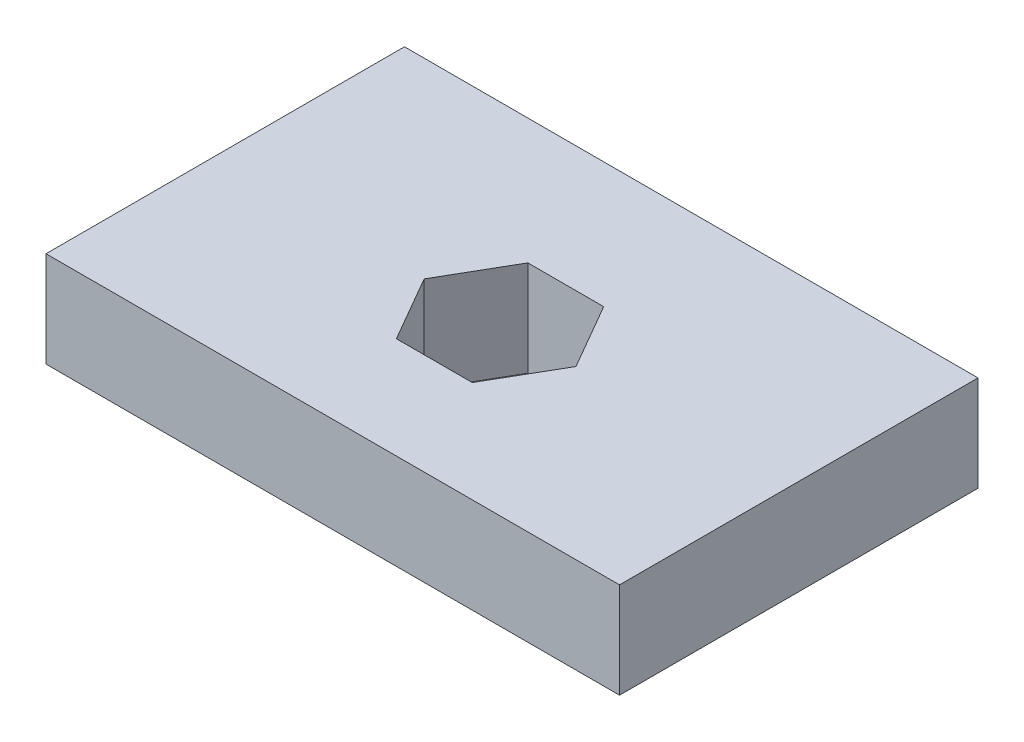
ISO-10303-21;
HEADER;
FILE_DESCRIPTION(('STEP AP214'),'2;1');
FILE_NAME('part.step','',(''),(''),'','','');
FILE_SCHEMA(('AUTOMOTIVE_DESIGN { 1 0 10303 214 1 1 1 1 }'));
ENDSEC;
DATA;
#1=APPLICATION_CONTEXT('core data for automotive mechanical design processes');
#2=APPLICATION_PROTOCOL_DEFINITION('international standard','automotive_design',2000,#1);
#3=PRODUCT_CONTEXT('',#1,'mechanical');
#4=PRODUCT('Part','Part','',(#3));
#5=PRODUCT_RELATED_PRODUCT_CATEGORY('part','',(#4));
#6=PRODUCT_DEFINITION_FORMATION('','',#4);
#7=PRODUCT_DEFINITION_CONTEXT('part definition',#1,'design');
#8=PRODUCT_DEFINITION('design','',#6,#7);
#9=PRODUCT_DEFINITION_SHAPE('','',#8);
#10=(LENGTH_UNIT() NAMED_UNIT(*) SI_UNIT(.MILLI.,.METRE.));
#11=(NAMED_UNIT(*) PLANE_ANGLE_UNIT() SI_UNIT($,.RADIAN.));
#12=(NAMED_UNIT(*) SI_UNIT($,.STERADIAN.) SOLID_ANGLE_UNIT());
#13=UNCERTAINTY_MEASURE_WITH_UNIT(LENGTH_MEASURE(1.E-05),#10,'distance_accuracy_value','');
#14=(GEOMETRIC_REPRESENTATION_CONTEXT(3) GLOBAL_UNCERTAINTY_ASSIGNED_CONTEXT((#13)) GLOBAL_UNIT_ASSIGNED_CONTEXT((#10,
#11,#12)) REPRESENTATION_CONTEXT('',''));
#15=CARTESIAN_POINT('',(0.,0.,0.));
#16=DIRECTION('',(0.,0.,1.));
#17=DIRECTION('',(1.,0.,0.));
#18=AXIS2_PLACEMENT_3D('',#15,#16,#17);
#19=CARTESIAN_POINT('',(-38.1,12.7,-25.4));
#20=DIRECTION('',(0.,-1.,0.));
#21=DIRECTION('',(0.,0.,-1.));
#22=AXIS2_PLACEMENT_3D('',#19,#20,#21);
#23=PLANE('',#22);
#24=DIRECTION('',(0.,0.,1.));
#25=VECTOR('',#24,1.);
#26=CARTESIAN_POINT('',(-38.1,12.7,22.225));
#27=LINE('',#26,#25);
#28=CARTESIAN_POINT('',(-38.1,12.7,-25.4));
#29=VERTEX_POINT('',#28);
#30=CARTESIAN_POINT('',(-38.1,12.7,22.225));
#31=VERTEX_POINT('',#30);
#32=EDGE_CURVE('E161',#29,#31,#27,.T.);
#33=ORIENTED_EDGE('',*,*,#32,.T.);
#34=DIRECTION('',(1.,0.,0.));
#35=VECTOR('',#34,1.);
#36=CARTESIAN_POINT('',(38.1,12.7,22.225));
#37=LINE('',#36,#35);
#38=CARTESIAN_POINT('',(38.1,12.7,22.225));
#39=VERTEX_POINT('',#38);
#40=EDGE_CURVE('E164',#31,#39,#37,.T.);
#41=ORIENTED_EDGE('',*,*,#40,.T.);
#42=DIRECTION('',(0.,0.,-1.));
#43=VECTOR('',#42,1.);
#44=CARTESIAN_POINT('',(38.1,12.7,-25.4));
#45=LINE('',#44,#43);
#46=CARTESIAN_POINT('',(38.1,12.7,-25.4));
#47=VERTEX_POINT('',#46);
#48=EDGE_CURVE('E167',#39,#47,#45,.T.);
#49=ORIENTED_EDGE('',*,*,#48,.T.);
#50=DIRECTION('',(-1.,0.,0.));
#51=VECTOR('',#50,1.);
#52=CARTESIAN_POINT('',(-38.1,12.7,-25.4));
#53=LINE('',#52,#51);
#54=EDGE_CURVE('E169',#47,#29,#53,.T.);
#55=ORIENTED_EDGE('',*,*,#54,.T.);
#56=EDGE_LOOP('',(#33,#41,#49,#55));
#57=FACE_BOUND('',#56,.T.);
#58=DIRECTION('',(0.5,0.,-0.866025403784439));
#59=VECTOR('',#58,1.);
#60=CARTESIAN_POINT('',(5.04098953786192,12.7,8.73125));
#61=LINE('',#60,#59);
#62=CARTESIAN_POINT('',(5.04098953786192,12.7,8.73125));
#63=VERTEX_POINT('',#62);
#64=CARTESIAN_POINT('',(10.0819790757238,12.7,0.));
#65=VERTEX_POINT('',#64);
#66=EDGE_CURVE('E108',#63,#65,#61,.T.);
#67=ORIENTED_EDGE('',*,*,#66,.F.);
#68=DIRECTION('',(1.,0.,0.));
#69=VECTOR('',#68,1.);
#70=CARTESIAN_POINT('',(-5.04098953786192,12.7,8.73125));
#71=LINE('',#70,#69);
#72=CARTESIAN_POINT('',(-5.04098953786192,12.7,8.73125));
#73=VERTEX_POINT('',#72);
#74=EDGE_CURVE('E138',#73,#63,#71,.T.);
#75=ORIENTED_EDGE('',*,*,#74,.F.);
#76=DIRECTION('',(0.5,0.,0.866025403784439));
#77=VECTOR('',#76,1.);
#78=CARTESIAN_POINT('',(-10.0819790757238,12.7,0.));
#79=LINE('',#78,#77);
#80=CARTESIAN_POINT('',(-10.0819790757238,12.7,0.));
#81=VERTEX_POINT('',#80);
#82=EDGE_CURVE('E136',#81,#73,#79,.T.);
#83=ORIENTED_EDGE('',*,*,#82,.F.);
#84=DIRECTION('',(-0.5,0.,0.866025403784439));
#85=VECTOR('',#84,1.);
#86=CARTESIAN_POINT('',(-5.04098953786192,12.7,-8.73125));
#87=LINE('',#86,#85);
#88=CARTESIAN_POINT('',(-5.04098953786192,12.7,-8.73125));
#89=VERTEX_POINT('',#88);
#90=EDGE_CURVE('E131',#89,#81,#87,.T.);
#91=ORIENTED_EDGE('',*,*,#90,.F.);
#92=DIRECTION('',(-1.,0.,0.));
#93=VECTOR('',#92,1.);
#94=CARTESIAN_POINT('',(5.04098953786192,12.7,-8.73125));
#95=LINE('',#94,#93);
#96=CARTESIAN_POINT('',(5.04098953786192,12.7,-8.73125));
#97=VERTEX_POINT('',#96);
#98=EDGE_CURVE('E129',#97,#89,#95,.T.);
#99=ORIENTED_EDGE('',*,*,#98,.F.);
#100=DIRECTION('',(-0.5,0.,-0.866025403784439));
#101=VECTOR('',#100,1.);
#102=CARTESIAN_POINT('',(10.0819790757238,12.7,0.));
#103=LINE('',#102,#101);
#104=EDGE_CURVE('E116',#65,#97,#103,.T.);
#105=ORIENTED_EDGE('',*,*,#104,.F.);
#106=EDGE_LOOP('',(#67,#75,#83,#91,#99,#105));
#107=FACE_BOUND('',#106,.T.);
#108=ADVANCED_FACE('F31',(#57,#107),#23,.F.);
#109=CARTESIAN_POINT('',(-38.1,0.,-25.4));
#110=DIRECTION('',(0.,-1.,0.));
#111=DIRECTION('',(0.,0.,-1.));
#112=AXIS2_PLACEMENT_3D('',#109,#110,#111);
#113=PLANE('',#112);
#114=DIRECTION('',(0.,0.,1.));
#115=VECTOR('',#114,1.);
#116=CARTESIAN_POINT('',(-38.1,0.,22.225));
#117=LINE('',#116,#115);
#118=CARTESIAN_POINT('',(-38.1,0.,-25.4));
#119=VERTEX_POINT('',#118);
#120=CARTESIAN_POINT('',(-38.1,0.,22.225));
#121=VERTEX_POINT('',#120);
#122=EDGE_CURVE('E124',#119,#121,#117,.T.);
#123=ORIENTED_EDGE('',*,*,#122,.F.);
#124=DIRECTION('',(-1.,0.,0.));
#125=VECTOR('',#124,1.);
#126=CARTESIAN_POINT('',(-38.1,0.,-25.4));
#127=LINE('',#126,#125);
#128=CARTESIAN_POINT('',(38.1,0.,-25.4));
#129=VERTEX_POINT('',#128);
#130=EDGE_CURVE('E165',#129,#119,#127,.T.);
#131=ORIENTED_EDGE('',*,*,#130,.F.);
#132=DIRECTION('',(0.,0.,-1.));
#133=VECTOR('',#132,1.);
#134=CARTESIAN_POINT('',(38.1,0.,-25.4));
#135=LINE('',#134,#133);
#136=CARTESIAN_POINT('',(38.1,0.,22.225));
#137=VERTEX_POINT('',#136);
#138=EDGE_CURVE('E176',#137,#129,#135,.T.);
#139=ORIENTED_EDGE('',*,*,#138,.F.);
#140=DIRECTION('',(1.,0.,0.));
#141=VECTOR('',#140,1.);
#142=CARTESIAN_POINT('',(38.1,0.,22.225));
#143=LINE('',#142,#141);
#144=EDGE_CURVE('E174',#121,#137,#143,.T.);
#145=ORIENTED_EDGE('',*,*,#144,.F.);
#146=EDGE_LOOP('',(#123,#131,#139,#145));
#147=FACE_BOUND('',#146,.T.);
#148=DIRECTION('',(1.,0.,0.));
#149=VECTOR('',#148,1.);
#150=CARTESIAN_POINT('',(-5.04098953786192,0.,8.73125));
#151=LINE('',#150,#149);
#152=CARTESIAN_POINT('',(-5.04098953786192,0.,8.73125));
#153=VERTEX_POINT('',#152);
#154=CARTESIAN_POINT('',(5.04098953786192,0.,8.73125));
#155=VERTEX_POINT('',#154);
#156=EDGE_CURVE('E117',#153,#155,#151,.T.);
#157=ORIENTED_EDGE('',*,*,#156,.T.);
#158=DIRECTION('',(0.5,0.,-0.866025403784439));
#159=VECTOR('',#158,1.);
#160=CARTESIAN_POINT('',(5.04098953786192,0.,8.73125));
#161=LINE('',#160,#159);
#162=CARTESIAN_POINT('',(10.0819790757238,0.,0.));
#163=VERTEX_POINT('',#162);
#164=EDGE_CURVE('E54',#155,#163,#161,.T.);
#165=ORIENTED_EDGE('',*,*,#164,.T.);
#166=DIRECTION('',(-0.5,0.,-0.866025403784439));
#167=VECTOR('',#166,1.);
#168=CARTESIAN_POINT('',(10.0819790757238,0.,0.));
#169=LINE('',#168,#167);
#170=CARTESIAN_POINT('',(5.04098953786192,0.,-8.73125));
#171=VERTEX_POINT('',#170);
#172=EDGE_CURVE('E123',#163,#171,#169,.T.);
#173=ORIENTED_EDGE('',*,*,#172,.T.);
#174=DIRECTION('',(-1.,0.,0.));
#175=VECTOR('',#174,1.);
#176=CARTESIAN_POINT('',(5.04098953786192,0.,-8.73125));
#177=LINE('',#176,#175);
#178=CARTESIAN_POINT('',(-5.04098953786192,0.,-8.73125));
#179=VERTEX_POINT('',#178);
#180=EDGE_CURVE('E143',#171,#179,#177,.T.);
#181=ORIENTED_EDGE('',*,*,#180,.T.);
#182=DIRECTION('',(-0.5,0.,0.866025403784439));
#183=VECTOR('',#182,1.);
#184=CARTESIAN_POINT('',(-5.04098953786192,0.,-8.73125));
#185=LINE('',#184,#183);
#186=CARTESIAN_POINT('',(-10.0819790757238,0.,0.));
#187=VERTEX_POINT('',#186);
#188=EDGE_CURVE('E146',#179,#187,#185,.T.);
#189=ORIENTED_EDGE('',*,*,#188,.T.);
#190=DIRECTION('',(0.5,0.,0.866025403784439));
#191=VECTOR('',#190,1.);
#192=CARTESIAN_POINT('',(-10.0819790757238,0.,0.));
#193=LINE('',#192,#191);
#194=EDGE_CURVE('E149',#187,#153,#193,.T.);
#195=ORIENTED_EDGE('',*,*,#194,.T.);
#196=EDGE_LOOP('',(#157,#165,#173,#181,#189,#195));
#197=FACE_BOUND('',#196,.T.);
#198=ADVANCED_FACE('F194',(#147,#197),#113,.T.);
#199=CARTESIAN_POINT('',(-38.1,12.7,22.225));
#200=DIRECTION('',(1.,0.,0.));
#201=DIRECTION('',(0.,0.,-1.));
#202=AXIS2_PLACEMENT_3D('',#199,#200,#201);
#203=PLANE('',#202);
#204=ORIENTED_EDGE('',*,*,#122,.T.);
#205=DIRECTION('',(0.,-1.,0.));
#206=VECTOR('',#205,1.);
#207=CARTESIAN_POINT('',(-38.1,12.7,22.225));
#208=LINE('',#207,#206);
#209=EDGE_CURVE('E11',#31,#121,#208,.T.);
#210=ORIENTED_EDGE('',*,*,#209,.F.);
#211=ORIENTED_EDGE('',*,*,#32,.F.);
#212=DIRECTION('',(0.,-1.,0.));
#213=VECTOR('',#212,1.);
#214=CARTESIAN_POINT('',(-38.1,12.7,-25.4));
#215=LINE('',#214,#213);
#216=EDGE_CURVE('E171',#29,#119,#215,.T.);
#217=ORIENTED_EDGE('',*,*,#216,.T.);
#218=EDGE_LOOP('',(#204,#210,#211,#217));
#219=FACE_BOUND('',#218,.T.);
#220=ADVANCED_FACE('F33',(#219),#203,.F.);
#221=CARTESIAN_POINT('',(38.1,12.7,22.225));
#222=DIRECTION('',(0.,0.,-1.));
#223=DIRECTION('',(-1.,0.,0.));
#224=AXIS2_PLACEMENT_3D('',#221,#222,#223);
#225=PLANE('',#224);
#226=ORIENTED_EDGE('',*,*,#144,.T.);
#227=DIRECTION('',(0.,-1.,0.));
#228=VECTOR('',#227,1.);
#229=CARTESIAN_POINT('',(38.1,12.7,22.225));
#230=LINE('',#229,#228);
#231=EDGE_CURVE('E39',#39,#137,#230,.T.);
#232=ORIENTED_EDGE('',*,*,#231,.F.);
#233=ORIENTED_EDGE('',*,*,#40,.F.);
#234=ORIENTED_EDGE('',*,*,#209,.T.);
#235=EDGE_LOOP('',(#226,#232,#233,#234));
#236=FACE_BOUND('',#235,.T.);
#237=ADVANCED_FACE('F204',(#236),#225,.F.);
#238=CARTESIAN_POINT('',(38.1,12.7,-25.4));
#239=DIRECTION('',(-1.,0.,0.));
#240=DIRECTION('',(0.,0.,1.));
#241=AXIS2_PLACEMENT_3D('',#238,#239,#240);
#242=PLANE('',#241);
#243=ORIENTED_EDGE('',*,*,#138,.T.);
#244=DIRECTION('',(0.,-1.,0.));
#245=VECTOR('',#244,1.);
#246=CARTESIAN_POINT('',(38.1,12.7,-25.4));
#247=LINE('',#246,#245);
#248=EDGE_CURVE('E181',#47,#129,#247,.T.);
#249=ORIENTED_EDGE('',*,*,#248,.F.);
#250=ORIENTED_EDGE('',*,*,#48,.F.);
#251=ORIENTED_EDGE('',*,*,#231,.T.);
#252=EDGE_LOOP('',(#243,#249,#250,#251));
#253=FACE_BOUND('',#252,.T.);
#254=ADVANCED_FACE('F188',(#253),#242,.F.);
#255=CARTESIAN_POINT('',(-38.1,12.7,-25.4));
#256=DIRECTION('',(0.,0.,1.));
#257=DIRECTION('',(1.,0.,0.));
#258=AXIS2_PLACEMENT_3D('',#255,#256,#257);
#259=PLANE('',#258);
#260=CARTESIAN_POINT('',(-25.4,6.35,-25.4));
#261=DIRECTION('',(0.,0.,-1.));
#262=DIRECTION('',(-1.,0.,0.));
#263=AXIS2_PLACEMENT_3D('',#260,#261,#262);
#264=CIRCLE('',#263,3.175);
#265=CARTESIAN_POINT('',(-28.575,6.35,-25.4));
#266=VERTEX_POINT('',#265);
#267=EDGE_CURVE('E228',#266,#266,#264,.T.);
#268=ORIENTED_EDGE('',*,*,#267,.F.);
#269=EDGE_LOOP('',(#268));
#270=FACE_BOUND('',#269,.T.);
#271=CARTESIAN_POINT('',(25.4,6.35,-25.4));
#272=DIRECTION('',(0.,0.,-1.));
#273=DIRECTION('',(-1.,0.,0.));
#274=AXIS2_PLACEMENT_3D('',#271,#272,#273);
#275=CIRCLE('',#274,3.175);
#276=CARTESIAN_POINT('',(22.225,6.35,-25.4));
#277=VERTEX_POINT('',#276);
#278=EDGE_CURVE('E231',#277,#277,#275,.T.);
#279=ORIENTED_EDGE('',*,*,#278,.F.);
#280=EDGE_LOOP('',(#279));
#281=FACE_BOUND('',#280,.T.);
#282=ORIENTED_EDGE('',*,*,#130,.T.);
#283=ORIENTED_EDGE('',*,*,#216,.F.);
#284=ORIENTED_EDGE('',*,*,#54,.F.);
#285=ORIENTED_EDGE('',*,*,#248,.T.);
#286=EDGE_LOOP('',(#282,#283,#284,#285));
#287=FACE_BOUND('',#286,.T.);
#288=ADVANCED_FACE('F198',(#270,#281,#287),#259,.F.);
#289=CARTESIAN_POINT('',(5.04098953786192,12.7,8.73125));
#290=DIRECTION('',(-0.866025403784439,0.,-0.5));
#291=DIRECTION('',(-0.5,0.,0.866025403784439));
#292=AXIS2_PLACEMENT_3D('',#289,#290,#291);
#293=PLANE('',#292);
#294=ORIENTED_EDGE('',*,*,#164,.F.);
#295=DIRECTION('',(0.,-1.,0.));
#296=VECTOR('',#295,1.);
#297=CARTESIAN_POINT('',(5.04098953786192,12.7,8.73125));
#298=LINE('',#297,#296);
#299=EDGE_CURVE('E112',#63,#155,#298,.T.);
#300=ORIENTED_EDGE('',*,*,#299,.F.);
#301=ORIENTED_EDGE('',*,*,#66,.T.);
#302=DIRECTION('',(0.,-1.,0.));
#303=VECTOR('',#302,1.);
#304=CARTESIAN_POINT('',(10.0819790757238,12.7,0.));
#305=LINE('',#304,#303);
#306=EDGE_CURVE('E111',#65,#163,#305,.T.);
#307=ORIENTED_EDGE('',*,*,#306,.T.);
#308=EDGE_LOOP('',(#294,#300,#301,#307));
#309=FACE_BOUND('',#308,.T.);
#310=ADVANCED_FACE('F110',(#309),#293,.T.);
#311=CARTESIAN_POINT('',(10.0819790757238,12.7,0.));
#312=DIRECTION('',(-0.866025403784439,0.,0.5));
#313=DIRECTION('',(0.5,0.,0.866025403784439));
#314=AXIS2_PLACEMENT_3D('',#311,#312,#313);
#315=PLANE('',#314);
#316=ORIENTED_EDGE('',*,*,#172,.F.);
#317=ORIENTED_EDGE('',*,*,#306,.F.);
#318=ORIENTED_EDGE('',*,*,#104,.T.);
#319=DIRECTION('',(0.,-1.,0.));
#320=VECTOR('',#319,1.);
#321=CARTESIAN_POINT('',(5.04098953786192,12.7,-8.73125));
#322=LINE('',#321,#320);
#323=EDGE_CURVE('E125',#97,#171,#322,.T.);
#324=ORIENTED_EDGE('',*,*,#323,.T.);
#325=EDGE_LOOP('',(#316,#317,#318,#324));
#326=FACE_BOUND('',#325,.T.);
#327=ADVANCED_FACE('F120',(#326),#315,.T.);
#328=CARTESIAN_POINT('',(5.04098953786192,12.7,-8.73125));
#329=DIRECTION('',(0.,0.,1.));
#330=DIRECTION('',(1.,0.,0.));
#331=AXIS2_PLACEMENT_3D('',#328,#329,#330);
#332=PLANE('',#331);
#333=ORIENTED_EDGE('',*,*,#180,.F.);
#334=ORIENTED_EDGE('',*,*,#323,.F.);
#335=ORIENTED_EDGE('',*,*,#98,.T.);
#336=DIRECTION('',(0.,-1.,0.));
#337=VECTOR('',#336,1.);
#338=CARTESIAN_POINT('',(-5.04098953786192,12.7,-8.73125));
#339=LINE('',#338,#337);
#340=EDGE_CURVE('E158',#89,#179,#339,.T.);
#341=ORIENTED_EDGE('',*,*,#340,.T.);
#342=EDGE_LOOP('',(#333,#334,#335,#341));
#343=FACE_BOUND('',#342,.T.);
#344=ADVANCED_FACE('F270',(#343),#332,.T.);
#345=CARTESIAN_POINT('',(-5.04098953786192,12.7,-8.73125));
#346=DIRECTION('',(0.866025403784439,0.,0.5));
#347=DIRECTION('',(0.5,0.,-0.866025403784439));
#348=AXIS2_PLACEMENT_3D('',#345,#346,#347);
#349=PLANE('',#348);
#350=ORIENTED_EDGE('',*,*,#188,.F.);
#351=ORIENTED_EDGE('',*,*,#340,.F.);
#352=ORIENTED_EDGE('',*,*,#90,.T.);
#353=DIRECTION('',(0.,-1.,0.));
#354=VECTOR('',#353,1.);
#355=CARTESIAN_POINT('',(-10.0819790757238,12.7,0.));
#356=LINE('',#355,#354);
#357=EDGE_CURVE('E156',#81,#187,#356,.T.);
#358=ORIENTED_EDGE('',*,*,#357,.T.);
#359=EDGE_LOOP('',(#350,#351,#352,#358));
#360=FACE_BOUND('',#359,.T.);
#361=ADVANCED_FACE('F266',(#360),#349,.T.);
#362=CARTESIAN_POINT('',(-10.0819790757238,12.7,0.));
#363=DIRECTION('',(0.866025403784439,0.,-0.5));
#364=DIRECTION('',(-0.5,0.,-0.866025403784439));
#365=AXIS2_PLACEMENT_3D('',#362,#363,#364);
#366=PLANE('',#365);
#367=ORIENTED_EDGE('',*,*,#194,.F.);
#368=ORIENTED_EDGE('',*,*,#357,.F.);
#369=ORIENTED_EDGE('',*,*,#82,.T.);
#370=DIRECTION('',(0.,-1.,0.));
#371=VECTOR('',#370,1.);
#372=CARTESIAN_POINT('',(-5.04098953786192,12.7,8.73125));
#373=LINE('',#372,#371);
#374=EDGE_CURVE('E46',#73,#153,#373,.T.);
#375=ORIENTED_EDGE('',*,*,#374,.T.);
#376=EDGE_LOOP('',(#367,#368,#369,#375));
#377=FACE_BOUND('',#376,.T.);
#378=ADVANCED_FACE('F263',(#377),#366,.T.);
#379=CARTESIAN_POINT('',(-5.04098953786192,12.7,8.73125));
#380=DIRECTION('',(0.,0.,-1.));
#381=DIRECTION('',(-1.,0.,0.));
#382=AXIS2_PLACEMENT_3D('',#379,#380,#381);
#383=PLANE('',#382);
#384=ORIENTED_EDGE('',*,*,#156,.F.);
#385=ORIENTED_EDGE('',*,*,#374,.F.);
#386=ORIENTED_EDGE('',*,*,#74,.T.);
#387=ORIENTED_EDGE('',*,*,#299,.T.);
#388=EDGE_LOOP('',(#384,#385,#386,#387));
#389=FACE_BOUND('',#388,.T.);
#390=ADVANCED_FACE('F259',(#389),#383,.T.);
#391=CARTESIAN_POINT('',(25.4,6.35,0.));
#392=DIRECTION('',(0.,0.,-1.));
#393=DIRECTION('',(-1.,0.,0.));
#394=AXIS2_PLACEMENT_3D('',#391,#392,#393);
#395=CYLINDRICAL_SURFACE('',#394,3.175);
#396=CARTESIAN_POINT('',(25.4,6.35,0.));
#397=DIRECTION('',(0.,0.,-1.));
#398=DIRECTION('',(-1.,0.,0.));
#399=AXIS2_PLACEMENT_3D('',#396,#397,#398);
#400=CIRCLE('',#399,3.175);
#401=CARTESIAN_POINT('',(22.225,6.35,0.));
#402=VERTEX_POINT('',#401);
#403=EDGE_CURVE('E141',#402,#402,#400,.T.);
#404=ORIENTED_EDGE('',*,*,#403,.F.);
#405=EDGE_LOOP('',(#404));
#406=FACE_BOUND('',#405,.T.);
#407=ORIENTED_EDGE('',*,*,#278,.T.);
#408=EDGE_LOOP('',(#407));
#409=FACE_BOUND('',#408,.T.);
#410=ADVANCED_FACE('F252',(#406,#409),#395,.F.);
#411=CARTESIAN_POINT('',(25.4,6.35,0.));
#412=DIRECTION('',(0.,0.,-1.));
#413=DIRECTION('',(-1.,0.,0.));
#414=AXIS2_PLACEMENT_3D('',#411,#412,#413);
#415=PLANE('',#414);
#416=ORIENTED_EDGE('',*,*,#403,.T.);
#417=EDGE_LOOP('',(#416));
#418=FACE_BOUND('',#417,.T.);
#419=ADVANCED_FACE('F243',(#418),#415,.T.);
#420=CARTESIAN_POINT('',(-25.4,6.35,0.));
#421=DIRECTION('',(0.,0.,-1.));
#422=DIRECTION('',(-1.,0.,0.));
#423=AXIS2_PLACEMENT_3D('',#420,#421,#422);
#424=CYLINDRICAL_SURFACE('',#423,3.175);
#425=CARTESIAN_POINT('',(-25.4,6.35,0.));
#426=DIRECTION('',(0.,0.,-1.));
#427=DIRECTION('',(-1.,0.,0.));
#428=AXIS2_PLACEMENT_3D('',#425,#426,#427);
#429=CIRCLE('',#428,3.175);
#430=CARTESIAN_POINT('',(-28.575,6.35,0.));
#431=VERTEX_POINT('',#430);
#432=EDGE_CURVE('E233',#431,#431,#429,.T.);
#433=ORIENTED_EDGE('',*,*,#432,.F.);
#434=EDGE_LOOP('',(#433));
#435=FACE_BOUND('',#434,.T.);
#436=ORIENTED_EDGE('',*,*,#267,.T.);
#437=EDGE_LOOP('',(#436));
#438=FACE_BOUND('',#437,.T.);
#439=ADVANCED_FACE('F240',(#435,#438),#424,.F.);
#440=CARTESIAN_POINT('',(-25.4,6.35,0.));
#441=DIRECTION('',(0.,0.,-1.));
#442=DIRECTION('',(-1.,0.,0.));
#443=AXIS2_PLACEMENT_3D('',#440,#441,#442);
#444=PLANE('',#443);
#445=ORIENTED_EDGE('',*,*,#432,.T.);
#446=EDGE_LOOP('',(#445));
#447=FACE_BOUND('',#446,.T.);
#448=ADVANCED_FACE('F242',(#447),#444,.T.);
#449=CLOSED_SHELL('',(#108,#198,#220,#237,#254,#288,#310,#327,#344,#361,#378,#390,#410,#419,
#439,#448));
#450=MANIFOLD_SOLID_BREP('B2',#449);
#451=ADVANCED_BREP_SHAPE_REPRESENTATION('',(#18,#450),#14);
#452=SHAPE_DEFINITION_REPRESENTATION(#9,#451);
ENDSEC;
END-ISO-10303-21;
